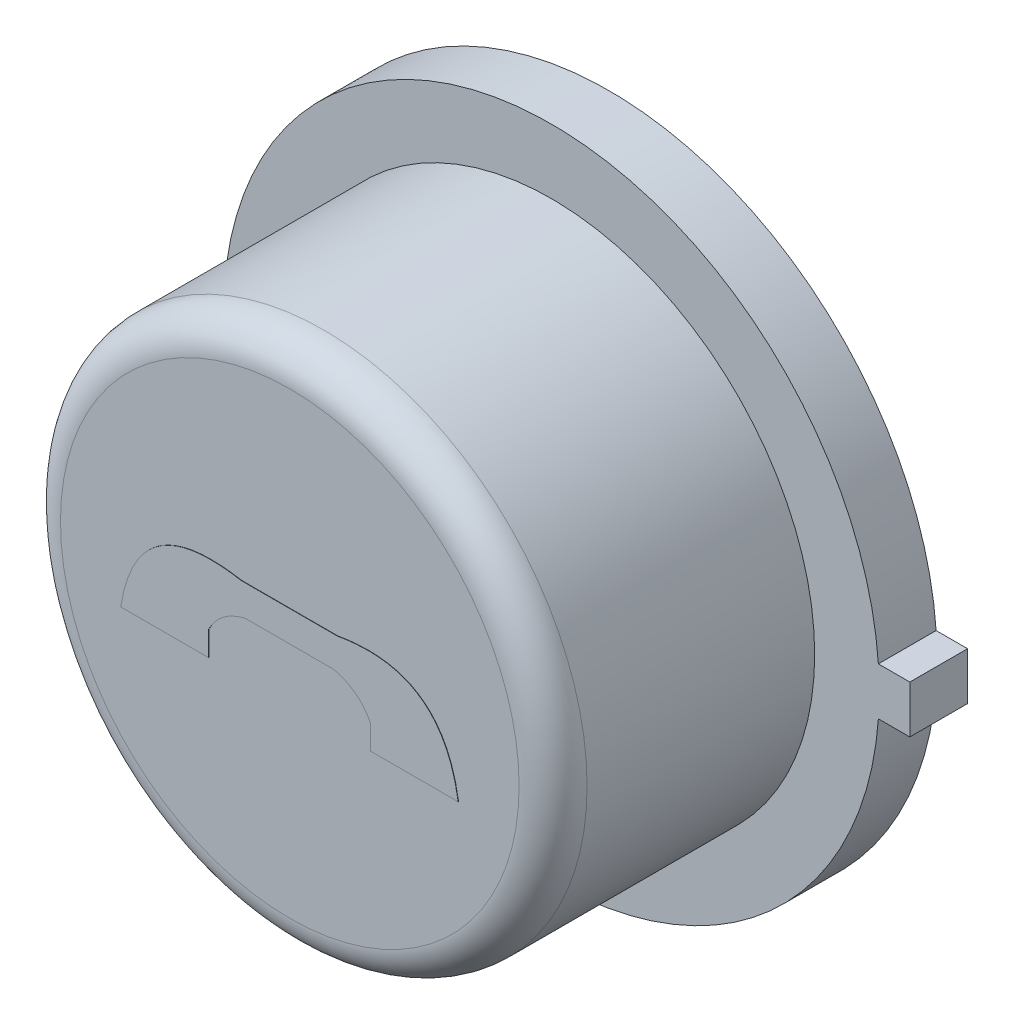
ISO-10303-21;
HEADER;
FILE_DESCRIPTION(('STEP AP214'),'2;1');
FILE_NAME('part.step','',(''),(''),'','','');
FILE_SCHEMA(('AUTOMOTIVE_DESIGN { 1 0 10303 214 1 1 1 1 }'));
ENDSEC;
DATA;
#1=APPLICATION_CONTEXT('core data for automotive mechanical design processes');
#2=APPLICATION_PROTOCOL_DEFINITION('international standard','automotive_design',2000,#1);
#3=PRODUCT_CONTEXT('',#1,'mechanical');
#4=PRODUCT('Part','Part','',(#3));
#5=PRODUCT_RELATED_PRODUCT_CATEGORY('part','',(#4));
#6=PRODUCT_DEFINITION_FORMATION('','',#4);
#7=PRODUCT_DEFINITION_CONTEXT('part definition',#1,'design');
#8=PRODUCT_DEFINITION('design','',#6,#7);
#9=PRODUCT_DEFINITION_SHAPE('','',#8);
#10=(LENGTH_UNIT() NAMED_UNIT(*) SI_UNIT(.MILLI.,.METRE.));
#11=(NAMED_UNIT(*) PLANE_ANGLE_UNIT() SI_UNIT($,.RADIAN.));
#12=(NAMED_UNIT(*) SI_UNIT($,.STERADIAN.) SOLID_ANGLE_UNIT());
#13=UNCERTAINTY_MEASURE_WITH_UNIT(LENGTH_MEASURE(1.E-05),#10,'distance_accuracy_value','');
#14=(GEOMETRIC_REPRESENTATION_CONTEXT(3) GLOBAL_UNCERTAINTY_ASSIGNED_CONTEXT((#13)) GLOBAL_UNIT_ASSIGNED_CONTEXT((#10,
#11,#12)) REPRESENTATION_CONTEXT('',''));
#15=CARTESIAN_POINT('',(0.,0.,0.));
#16=DIRECTION('',(0.,0.,1.));
#17=DIRECTION('',(1.,0.,0.));
#18=AXIS2_PLACEMENT_3D('',#15,#16,#17);
#19=CARTESIAN_POINT('',(0.,0.,2.3876));
#20=DIRECTION('',(0.,0.,1.));
#21=DIRECTION('',(1.,0.,0.));
#22=AXIS2_PLACEMENT_3D('',#19,#20,#21);
#23=PLANE('',#22);
#24=CARTESIAN_POINT('',(0.,0.,2.3876));
#25=DIRECTION('',(0.,0.,1.));
#26=DIRECTION('',(1.,0.,0.));
#27=AXIS2_PLACEMENT_3D('',#24,#25,#26);
#28=CIRCLE('',#27,1.7145);
#29=CARTESIAN_POINT('',(1.7145,0.,2.3876));
#30=VERTEX_POINT('',#29);
#31=EDGE_CURVE('E43',#30,#30,#28,.T.);
#32=ORIENTED_EDGE('',*,*,#31,.T.);
#33=EDGE_LOOP('',(#32));
#34=FACE_BOUND('',#33,.T.);
#35=CARTESIAN_POINT('',(0.605919476379509,-0.145694878798674,2.3876));
#36=CARTESIAN_POINT('',(0.520411043392596,0.0208845483871325,2.3876));
#37=CARTESIAN_POINT('',(0.328774142567382,0.0645533054725954,2.3876));
#38=B_SPLINE_CURVE_WITH_KNOTS('',2,(#35,#36,#37),.UNSPECIFIED.,.F.,.F.,(3,3),(0.,1.),.UNSPECIFIED.);
#39=CARTESIAN_POINT('',(0.605919476379509,-0.145694878798674,2.3876));
#40=VERTEX_POINT('',#39);
#41=CARTESIAN_POINT('',(0.328774142567381,0.0645533054725953,2.3876));
#42=VERTEX_POINT('',#41);
#43=EDGE_CURVE('E447',#40,#42,#38,.T.);
#44=ORIENTED_EDGE('',*,*,#43,.T.);
#45=DIRECTION('',(1.,0.,0.));
#46=VECTOR('',#45,1.);
#47=CARTESIAN_POINT('',(0.,0.0645533054725953,2.3876));
#48=LINE('',#47,#46);
#49=CARTESIAN_POINT('',(-0.328774142567381,0.0645533054725953,2.3876));
#50=VERTEX_POINT('',#49);
#51=EDGE_CURVE('E160',#50,#42,#48,.T.);
#52=ORIENTED_EDGE('',*,*,#51,.F.);
#53=CARTESIAN_POINT('',(-0.605919476379509,-0.145694878798674,2.3876));
#54=CARTESIAN_POINT('',(-0.520411043392595,0.0208845483871324,2.3876));
#55=CARTESIAN_POINT('',(-0.328774142567381,0.0645533054725953,2.3876));
#56=B_SPLINE_CURVE_WITH_KNOTS('',2,(#53,#54,#55),.UNSPECIFIED.,.F.,.F.,(3,3),(0.,1.),.UNSPECIFIED.);
#57=CARTESIAN_POINT('',(-0.605919476379509,-0.145694878798674,2.3876));
#58=VERTEX_POINT('',#57);
#59=EDGE_CURVE('E154',#58,#50,#56,.T.);
#60=ORIENTED_EDGE('',*,*,#59,.F.);
#61=DIRECTION('',(0.,1.,0.));
#62=VECTOR('',#61,1.);
#63=CARTESIAN_POINT('',(-0.605919476379509,-3.91332135623731,2.3876));
#64=LINE('',#63,#62);
#65=CARTESIAN_POINT('',(-0.605919476379509,-0.327272856123861,2.3876));
#66=VERTEX_POINT('',#65);
#67=EDGE_CURVE('E481',#66,#58,#64,.T.);
#68=ORIENTED_EDGE('',*,*,#67,.F.);
#69=DIRECTION('',(1.,0.,0.));
#70=VECTOR('',#69,1.);
#71=CARTESIAN_POINT('',(0.,-0.327272856123861,2.3876));
#72=LINE('',#71,#70);
#73=CARTESIAN_POINT('',(-1.26168609818704,-0.327272856123861,2.3876));
#74=VERTEX_POINT('',#73);
#75=EDGE_CURVE('E476',#74,#66,#72,.T.);
#76=ORIENTED_EDGE('',*,*,#75,.F.);
#77=CARTESIAN_POINT('',(-1.26168609818704,-0.327272856123861,2.3876));
#78=CARTESIAN_POINT('',(-1.14250792995546,0.434027967655186,2.3876));
#79=CARTESIAN_POINT('',(-0.35985696491855,0.293914961041253,2.3876));
#80=B_SPLINE_CURVE_WITH_KNOTS('',2,(#77,#78,#79),.UNSPECIFIED.,.F.,.F.,(3,3),(0.,1.),.UNSPECIFIED.);
#81=CARTESIAN_POINT('',(-0.35985696491855,0.293914961041253,2.3876));
#82=VERTEX_POINT('',#81);
#83=EDGE_CURVE('E471',#74,#82,#80,.T.);
#84=ORIENTED_EDGE('',*,*,#83,.T.);
#85=DIRECTION('',(1.,0.,0.));
#86=VECTOR('',#85,1.);
#87=CARTESIAN_POINT('',(0.,0.293914961041253,2.3876));
#88=LINE('',#87,#86);
#89=CARTESIAN_POINT('',(0.35985696491855,0.293914961041253,2.3876));
#90=VERTEX_POINT('',#89);
#91=EDGE_CURVE('E465',#82,#90,#88,.T.);
#92=ORIENTED_EDGE('',*,*,#91,.T.);
#93=CARTESIAN_POINT('',(1.26168609818704,-0.327272856123861,2.3876));
#94=CARTESIAN_POINT('',(1.14250792995546,0.434027967655186,2.3876));
#95=CARTESIAN_POINT('',(0.35985696491855,0.293914961041253,2.3876));
#96=B_SPLINE_CURVE_WITH_KNOTS('',2,(#93,#94,#95),.UNSPECIFIED.,.F.,.F.,(3,3),(0.,1.),.UNSPECIFIED.);
#97=CARTESIAN_POINT('',(1.26168609818704,-0.327272856123861,2.3876));
#98=VERTEX_POINT('',#97);
#99=EDGE_CURVE('E460',#98,#90,#96,.T.);
#100=ORIENTED_EDGE('',*,*,#99,.F.);
#101=DIRECTION('',(-1.,0.,0.));
#102=VECTOR('',#101,1.);
#103=CARTESIAN_POINT('',(0.,-0.327272856123861,2.3876));
#104=LINE('',#103,#102);
#105=CARTESIAN_POINT('',(0.605919476379509,-0.327272856123861,2.3876));
#106=VERTEX_POINT('',#105);
#107=EDGE_CURVE('E457',#98,#106,#104,.T.);
#108=ORIENTED_EDGE('',*,*,#107,.T.);
#109=DIRECTION('',(0.,1.,0.));
#110=VECTOR('',#109,1.);
#111=CARTESIAN_POINT('',(0.605919476379509,-3.91332135623731,2.3876));
#112=LINE('',#111,#110);
#113=EDGE_CURVE('E451',#106,#40,#112,.T.);
#114=ORIENTED_EDGE('',*,*,#113,.T.);
#115=EDGE_LOOP('',(#44,#52,#60,#68,#76,#84,#92,#100,#108,#114));
#116=FACE_BOUND('',#115,.T.);
#117=ADVANCED_FACE('F35',(#34,#116),#23,.T.);
#118=CARTESIAN_POINT('',(-0.00322860507148085,-5.53029106093277,0.));
#119=DIRECTION('',(0.,0.,1.));
#120=DIRECTION('',(1.,0.,0.));
#121=AXIS2_PLACEMENT_3D('',#118,#119,#120);
#122=PLANE('',#121);
#123=DIRECTION('',(1.,0.,0.));
#124=VECTOR('',#123,1.);
#125=CARTESIAN_POINT('',(-0.0032286050714822,0.177799999999999,0.));
#126=LINE('',#125,#124);
#127=CARTESIAN_POINT('',(2.44464278985704,0.177799999999999,0.));
#128=VERTEX_POINT('',#127);
#129=CARTESIAN_POINT('',(2.6797,0.177799999999999,0.));
#130=VERTEX_POINT('',#129);
#131=EDGE_CURVE('E224',#128,#130,#126,.T.);
#132=ORIENTED_EDGE('',*,*,#131,.T.);
#133=DIRECTION('',(0.,-1.,0.));
#134=VECTOR('',#133,1.);
#135=CARTESIAN_POINT('',(2.6797,-5.53029106093277,0.));
#136=LINE('',#135,#134);
#137=CARTESIAN_POINT('',(2.6797,-0.1778,0.));
#138=VERTEX_POINT('',#137);
#139=EDGE_CURVE('E241',#130,#138,#136,.T.);
#140=ORIENTED_EDGE('',*,*,#139,.T.);
#141=DIRECTION('',(-1.,0.,0.));
#142=VECTOR('',#141,1.);
#143=CARTESIAN_POINT('',(-0.00322860507148085,-0.1778,0.));
#144=LINE('',#143,#142);
#145=CARTESIAN_POINT('',(2.44464278985704,-0.1778,0.));
#146=VERTEX_POINT('',#145);
#147=EDGE_CURVE('E231',#138,#146,#144,.T.);
#148=ORIENTED_EDGE('',*,*,#147,.T.);
#149=CARTESIAN_POINT('',(0.,0.,0.));
#150=DIRECTION('',(0.,0.,1.));
#151=DIRECTION('',(1.,0.,0.));
#152=AXIS2_PLACEMENT_3D('',#149,#150,#151);
#153=CIRCLE('',#152,2.4511);
#154=EDGE_CURVE('E227',#128,#146,#153,.T.);
#155=ORIENTED_EDGE('',*,*,#154,.F.);
#156=EDGE_LOOP('',(#132,#140,#148,#155));
#157=FACE_BOUND('',#156,.T.);
#158=CARTESIAN_POINT('',(0.,0.,0.));
#159=DIRECTION('',(0.,0.,1.));
#160=DIRECTION('',(1.,0.,0.));
#161=AXIS2_PLACEMENT_3D('',#158,#159,#160);
#162=CIRCLE('',#161,1.75756648099992);
#163=CARTESIAN_POINT('',(1.75756648099992,0.,0.));
#164=VERTEX_POINT('',#163);
#165=EDGE_CURVE('E250',#164,#164,#162,.F.);
#166=ORIENTED_EDGE('',*,*,#165,.F.);
#167=EDGE_LOOP('',(#166));
#168=FACE_BOUND('',#167,.T.);
#169=ADVANCED_FACE('F198',(#157,#168),#122,.F.);
#170=CARTESIAN_POINT('',(-0.00322860507148085,-5.53029106093277,0.4318));
#171=DIRECTION('',(0.,0.,1.));
#172=DIRECTION('',(1.,0.,0.));
#173=AXIS2_PLACEMENT_3D('',#170,#171,#172);
#174=PLANE('',#173);
#175=DIRECTION('',(1.,0.,0.));
#176=VECTOR('',#175,1.);
#177=CARTESIAN_POINT('',(-0.0032286050714822,0.177799999999999,0.4318));
#178=LINE('',#177,#176);
#179=CARTESIAN_POINT('',(2.44464278985704,0.177799999999999,0.4318));
#180=VERTEX_POINT('',#179);
#181=CARTESIAN_POINT('',(2.6797,0.177799999999999,0.4318));
#182=VERTEX_POINT('',#181);
#183=EDGE_CURVE('E243',#180,#182,#178,.T.);
#184=ORIENTED_EDGE('',*,*,#183,.F.);
#185=CARTESIAN_POINT('',(0.,0.,0.4318));
#186=DIRECTION('',(0.,0.,1.));
#187=DIRECTION('',(1.,0.,0.));
#188=AXIS2_PLACEMENT_3D('',#185,#186,#187);
#189=CIRCLE('',#188,2.4511);
#190=CARTESIAN_POINT('',(2.44464278985704,-0.1778,0.4318));
#191=VERTEX_POINT('',#190);
#192=EDGE_CURVE('E508',#180,#191,#189,.T.);
#193=ORIENTED_EDGE('',*,*,#192,.T.);
#194=DIRECTION('',(-1.,0.,0.));
#195=VECTOR('',#194,1.);
#196=CARTESIAN_POINT('',(-0.00322860507148085,-0.1778,0.4318));
#197=LINE('',#196,#195);
#198=CARTESIAN_POINT('',(2.6797,-0.1778,0.4318));
#199=VERTEX_POINT('',#198);
#200=EDGE_CURVE('E509',#199,#191,#197,.T.);
#201=ORIENTED_EDGE('',*,*,#200,.F.);
#202=DIRECTION('',(0.,-1.,0.));
#203=VECTOR('',#202,1.);
#204=CARTESIAN_POINT('',(2.6797,-5.53029106093277,0.4318));
#205=LINE('',#204,#203);
#206=EDGE_CURVE('E236',#182,#199,#205,.T.);
#207=ORIENTED_EDGE('',*,*,#206,.F.);
#208=EDGE_LOOP('',(#184,#193,#201,#207));
#209=FACE_BOUND('',#208,.T.);
#210=CARTESIAN_POINT('',(0.,0.,0.4318));
#211=DIRECTION('',(0.,0.,1.));
#212=DIRECTION('',(1.,0.,0.));
#213=AXIS2_PLACEMENT_3D('',#210,#211,#212);
#214=CIRCLE('',#213,1.9685);
#215=CARTESIAN_POINT('',(1.9685,0.,0.4318));
#216=VERTEX_POINT('',#215);
#217=EDGE_CURVE('E228',#216,#216,#214,.T.);
#218=ORIENTED_EDGE('',*,*,#217,.F.);
#219=EDGE_LOOP('',(#218));
#220=FACE_BOUND('',#219,.T.);
#221=ADVANCED_FACE('F204',(#209,#220),#174,.T.);
#222=CARTESIAN_POINT('',(-0.0032286050714822,0.177799999999999,0.4318));
#223=DIRECTION('',(0.,1.,0.));
#224=DIRECTION('',(-1.,0.,0.));
#225=AXIS2_PLACEMENT_3D('',#222,#223,#224);
#226=PLANE('',#225);
#227=ORIENTED_EDGE('',*,*,#131,.F.);
#228=DIRECTION('',(0.,0.,-1.));
#229=VECTOR('',#228,1.);
#230=CARTESIAN_POINT('',(2.44464278985704,0.177799999999999,0.4318));
#231=LINE('',#230,#229);
#232=EDGE_CURVE('E82',#180,#128,#231,.T.);
#233=ORIENTED_EDGE('',*,*,#232,.F.);
#234=ORIENTED_EDGE('',*,*,#183,.T.);
#235=DIRECTION('',(0.,0.,-1.));
#236=VECTOR('',#235,1.);
#237=CARTESIAN_POINT('',(2.6797,0.177799999999999,0.4318));
#238=LINE('',#237,#236);
#239=EDGE_CURVE('E59',#182,#130,#238,.T.);
#240=ORIENTED_EDGE('',*,*,#239,.T.);
#241=EDGE_LOOP('',(#227,#233,#234,#240));
#242=FACE_BOUND('',#241,.T.);
#243=ADVANCED_FACE('F207',(#242),#226,.T.);
#244=CARTESIAN_POINT('',(0.,0.,0.4318));
#245=DIRECTION('',(0.,0.,-1.));
#246=DIRECTION('',(-1.,0.,0.));
#247=AXIS2_PLACEMENT_3D('',#244,#245,#246);
#248=CYLINDRICAL_SURFACE('',#247,2.4511);
#249=ORIENTED_EDGE('',*,*,#154,.T.);
#250=DIRECTION('',(0.,0.,-1.));
#251=VECTOR('',#250,1.);
#252=CARTESIAN_POINT('',(2.44464278985704,-0.1778,0.4318));
#253=LINE('',#252,#251);
#254=EDGE_CURVE('E247',#191,#146,#253,.T.);
#255=ORIENTED_EDGE('',*,*,#254,.F.);
#256=ORIENTED_EDGE('',*,*,#192,.F.);
#257=ORIENTED_EDGE('',*,*,#232,.T.);
#258=EDGE_LOOP('',(#249,#255,#256,#257));
#259=FACE_BOUND('',#258,.T.);
#260=ADVANCED_FACE('F217',(#259),#248,.T.);
#261=CARTESIAN_POINT('',(-0.00322860507148085,-0.1778,0.4318));
#262=DIRECTION('',(0.,-1.,0.));
#263=DIRECTION('',(0.,0.,-1.));
#264=AXIS2_PLACEMENT_3D('',#261,#262,#263);
#265=PLANE('',#264);
#266=ORIENTED_EDGE('',*,*,#147,.F.);
#267=DIRECTION('',(0.,0.,-1.));
#268=VECTOR('',#267,1.);
#269=CARTESIAN_POINT('',(2.6797,-0.1778,0.4318));
#270=LINE('',#269,#268);
#271=EDGE_CURVE('E245',#199,#138,#270,.T.);
#272=ORIENTED_EDGE('',*,*,#271,.F.);
#273=ORIENTED_EDGE('',*,*,#200,.T.);
#274=ORIENTED_EDGE('',*,*,#254,.T.);
#275=EDGE_LOOP('',(#266,#272,#273,#274));
#276=FACE_BOUND('',#275,.T.);
#277=ADVANCED_FACE('F214',(#276),#265,.T.);
#278=CARTESIAN_POINT('',(2.6797,-5.53029106093277,0.4318));
#279=DIRECTION('',(1.,0.,0.));
#280=DIRECTION('',(0.,0.,-1.));
#281=AXIS2_PLACEMENT_3D('',#278,#279,#280);
#282=PLANE('',#281);
#283=ORIENTED_EDGE('',*,*,#139,.F.);
#284=ORIENTED_EDGE('',*,*,#239,.F.);
#285=ORIENTED_EDGE('',*,*,#206,.T.);
#286=ORIENTED_EDGE('',*,*,#271,.T.);
#287=EDGE_LOOP('',(#283,#284,#285,#286));
#288=FACE_BOUND('',#287,.T.);
#289=ADVANCED_FACE('F202',(#288),#282,.T.);
#290=CARTESIAN_POINT('',(0.,0.,2.3876));
#291=DIRECTION('',(0.,0.,-1.));
#292=DIRECTION('',(-1.,0.,0.));
#293=AXIS2_PLACEMENT_3D('',#290,#291,#292);
#294=CYLINDRICAL_SURFACE('',#293,1.9685);
#295=CARTESIAN_POINT('',(0.,0.,2.1336));
#296=DIRECTION('',(0.,0.,1.));
#297=DIRECTION('',(1.,0.,0.));
#298=AXIS2_PLACEMENT_3D('',#295,#296,#297);
#299=CIRCLE('',#298,1.9685);
#300=CARTESIAN_POINT('',(1.9685,0.,2.1336));
#301=VERTEX_POINT('',#300);
#302=EDGE_CURVE('E11',#301,#301,#299,.F.);
#303=ORIENTED_EDGE('',*,*,#302,.T.);
#304=EDGE_LOOP('',(#303));
#305=FACE_BOUND('',#304,.T.);
#306=ORIENTED_EDGE('',*,*,#217,.T.);
#307=EDGE_LOOP('',(#306));
#308=FACE_BOUND('',#307,.T.);
#309=ADVANCED_FACE('F194',(#305,#308),#294,.T.);
#310=CARTESIAN_POINT('',(0.,0.,-0.00254));
#311=DIRECTION('',(0.,0.,1.));
#312=DIRECTION('',(1.,0.,0.));
#313=AXIS2_PLACEMENT_3D('',#310,#311,#312);
#314=CYLINDRICAL_SURFACE('',#313,1.75756648099992);
#315=CARTESIAN_POINT('',(0.,0.,-0.00254));
#316=DIRECTION('',(0.,0.,-1.));
#317=DIRECTION('',(-1.,0.,0.));
#318=AXIS2_PLACEMENT_3D('',#315,#316,#317);
#319=CIRCLE('',#318,1.75756648099992);
#320=CARTESIAN_POINT('',(-1.75756648099992,0.,-0.00254));
#321=VERTEX_POINT('',#320);
#322=EDGE_CURVE('E164',#321,#321,#319,.T.);
#323=ORIENTED_EDGE('',*,*,#322,.F.);
#324=EDGE_LOOP('',(#323));
#325=FACE_BOUND('',#324,.T.);
#326=ORIENTED_EDGE('',*,*,#165,.T.);
#327=EDGE_LOOP('',(#326));
#328=FACE_BOUND('',#327,.T.);
#329=ADVANCED_FACE('F190',(#325,#328),#314,.T.);
#330=CARTESIAN_POINT('',(0.,0.,-0.00254));
#331=DIRECTION('',(0.,0.,-1.));
#332=DIRECTION('',(-1.,0.,0.));
#333=AXIS2_PLACEMENT_3D('',#330,#331,#332);
#334=PLANE('',#333);
#335=ORIENTED_EDGE('',*,*,#322,.T.);
#336=EDGE_LOOP('',(#335));
#337=FACE_BOUND('',#336,.T.);
#338=ADVANCED_FACE('F187',(#337),#334,.T.);
#339=CARTESIAN_POINT('',(0.,0.,2.1336));
#340=DIRECTION('',(0.,0.,1.));
#341=DIRECTION('',(1.,0.,0.));
#342=AXIS2_PLACEMENT_3D('',#339,#340,#341);
#343=TOROIDAL_SURFACE('',#342,1.7145,0.254);
#344=ORIENTED_EDGE('',*,*,#302,.F.);
#345=EDGE_LOOP('',(#344));
#346=FACE_BOUND('',#345,.T.);
#347=ORIENTED_EDGE('',*,*,#31,.F.);
#348=EDGE_LOOP('',(#347));
#349=FACE_BOUND('',#348,.T.);
#350=ADVANCED_FACE('F37',(#346,#349),#343,.T.);
#351=CARTESIAN_POINT('',(0.,0.0645533054725953,2.39014));
#352=DIRECTION('',(0.,1.,0.));
#353=DIRECTION('',(0.,0.,1.));
#354=AXIS2_PLACEMENT_3D('',#351,#352,#353);
#355=PLANE('',#354);
#356=ORIENTED_EDGE('',*,*,#51,.T.);
#357=DIRECTION('',(0.,0.,-1.));
#358=VECTOR('',#357,1.);
#359=CARTESIAN_POINT('',(0.328774142567381,0.0645533054725953,2.39014));
#360=LINE('',#359,#358);
#361=CARTESIAN_POINT('',(0.328774142567381,0.0645533054725953,2.39014));
#362=VERTEX_POINT('',#361);
#363=EDGE_CURVE('E157',#362,#42,#360,.T.);
#364=ORIENTED_EDGE('',*,*,#363,.F.);
#365=DIRECTION('',(1.,0.,0.));
#366=VECTOR('',#365,1.);
#367=CARTESIAN_POINT('',(0.,0.0645533054725953,2.39014));
#368=LINE('',#367,#366);
#369=CARTESIAN_POINT('',(-0.328774142567381,0.0645533054725953,2.39014));
#370=VERTEX_POINT('',#369);
#371=EDGE_CURVE('E143',#370,#362,#368,.T.);
#372=ORIENTED_EDGE('',*,*,#371,.F.);
#373=DIRECTION('',(0.,0.,-1.));
#374=VECTOR('',#373,1.);
#375=CARTESIAN_POINT('',(-0.328774142567381,0.0645533054725953,2.39014));
#376=LINE('',#375,#374);
#377=EDGE_CURVE('E440',#370,#50,#376,.T.);
#378=ORIENTED_EDGE('',*,*,#377,.T.);
#379=EDGE_LOOP('',(#356,#364,#372,#378));
#380=FACE_BOUND('',#379,.T.);
#381=ADVANCED_FACE('F158',(#380),#355,.F.);
#382=CARTESIAN_POINT('',(0.605919476379509,-0.145694878798674,2.39014));
#383=CARTESIAN_POINT('',(0.520411043392596,0.0208845483871325,2.39014));
#384=CARTESIAN_POINT('',(0.328774142567382,0.0645533054725954,2.39014));
#385=B_SPLINE_CURVE_WITH_KNOTS('',2,(#382,#383,#384),.UNSPECIFIED.,.F.,.F.,(3,3),(0.,1.),.UNSPECIFIED.);
#386=DIRECTION('',(0.,0.,-1.));
#387=VECTOR('',#386,1.);
#388=SURFACE_OF_LINEAR_EXTRUSION('',#385,#387);
#389=ORIENTED_EDGE('',*,*,#43,.F.);
#390=DIRECTION('',(0.,0.,-1.));
#391=VECTOR('',#390,1.);
#392=CARTESIAN_POINT('',(0.605919476379509,-0.145694878798674,2.39014));
#393=LINE('',#392,#391);
#394=CARTESIAN_POINT('',(0.605919476379509,-0.145694878798674,2.39014));
#395=VERTEX_POINT('',#394);
#396=EDGE_CURVE('E165',#395,#40,#393,.T.);
#397=ORIENTED_EDGE('',*,*,#396,.F.);
#398=EDGE_CURVE('E148',#395,#362,#385,.T.);
#399=ORIENTED_EDGE('',*,*,#398,.T.);
#400=ORIENTED_EDGE('',*,*,#363,.T.);
#401=EDGE_LOOP('',(#389,#397,#399,#400));
#402=FACE_BOUND('',#401,.T.);
#403=ADVANCED_FACE('F167',(#402),#388,.T.);
#404=CARTESIAN_POINT('',(0.605919476379509,-3.91332135623731,2.39014));
#405=DIRECTION('',(-1.,0.,0.));
#406=DIRECTION('',(0.,0.,1.));
#407=AXIS2_PLACEMENT_3D('',#404,#405,#406);
#408=PLANE('',#407);
#409=ORIENTED_EDGE('',*,*,#113,.F.);
#410=DIRECTION('',(0.,0.,-1.));
#411=VECTOR('',#410,1.);
#412=CARTESIAN_POINT('',(0.605919476379509,-0.327272856123861,2.39014));
#413=LINE('',#412,#411);
#414=CARTESIAN_POINT('',(0.605919476379509,-0.327272856123861,2.39014));
#415=VERTEX_POINT('',#414);
#416=EDGE_CURVE('E502',#415,#106,#413,.T.);
#417=ORIENTED_EDGE('',*,*,#416,.F.);
#418=DIRECTION('',(0.,1.,0.));
#419=VECTOR('',#418,1.);
#420=CARTESIAN_POINT('',(0.605919476379509,-3.91332135623731,2.39014));
#421=LINE('',#420,#419);
#422=EDGE_CURVE('E168',#415,#395,#421,.T.);
#423=ORIENTED_EDGE('',*,*,#422,.T.);
#424=ORIENTED_EDGE('',*,*,#396,.T.);
#425=EDGE_LOOP('',(#409,#417,#423,#424));
#426=FACE_BOUND('',#425,.T.);
#427=ADVANCED_FACE('F183',(#426),#408,.T.);
#428=CARTESIAN_POINT('',(0.,-0.327272856123861,2.39014));
#429=DIRECTION('',(0.,-1.,0.));
#430=DIRECTION('',(0.,0.,-1.));
#431=AXIS2_PLACEMENT_3D('',#428,#429,#430);
#432=PLANE('',#431);
#433=ORIENTED_EDGE('',*,*,#107,.F.);
#434=DIRECTION('',(0.,0.,-1.));
#435=VECTOR('',#434,1.);
#436=CARTESIAN_POINT('',(1.26168609818704,-0.327272856123861,2.39014));
#437=LINE('',#436,#435);
#438=CARTESIAN_POINT('',(1.26168609818704,-0.327272856123861,2.39014));
#439=VERTEX_POINT('',#438);
#440=EDGE_CURVE('E500',#439,#98,#437,.T.);
#441=ORIENTED_EDGE('',*,*,#440,.F.);
#442=DIRECTION('',(-1.,0.,0.));
#443=VECTOR('',#442,1.);
#444=CARTESIAN_POINT('',(0.,-0.327272856123861,2.39014));
#445=LINE('',#444,#443);
#446=EDGE_CURVE('E170',#439,#415,#445,.T.);
#447=ORIENTED_EDGE('',*,*,#446,.T.);
#448=ORIENTED_EDGE('',*,*,#416,.T.);
#449=EDGE_LOOP('',(#433,#441,#447,#448));
#450=FACE_BOUND('',#449,.T.);
#451=ADVANCED_FACE('F282',(#450),#432,.T.);
#452=CARTESIAN_POINT('',(1.26168609818704,-0.327272856123861,2.39014));
#453=CARTESIAN_POINT('',(1.14250792995546,0.434027967655186,2.39014));
#454=CARTESIAN_POINT('',(0.35985696491855,0.293914961041253,2.39014));
#455=B_SPLINE_CURVE_WITH_KNOTS('',2,(#452,#453,#454),.UNSPECIFIED.,.F.,.F.,(3,3),(0.,1.),.UNSPECIFIED.);
#456=DIRECTION('',(0.,0.,-1.));
#457=VECTOR('',#456,1.);
#458=SURFACE_OF_LINEAR_EXTRUSION('',#455,#457);
#459=ORIENTED_EDGE('',*,*,#99,.T.);
#460=DIRECTION('',(0.,0.,-1.));
#461=VECTOR('',#460,1.);
#462=CARTESIAN_POINT('',(0.35985696491855,0.293914961041253,2.39014));
#463=LINE('',#462,#461);
#464=CARTESIAN_POINT('',(0.35985696491855,0.293914961041253,2.39014));
#465=VERTEX_POINT('',#464);
#466=EDGE_CURVE('E498',#465,#90,#463,.T.);
#467=ORIENTED_EDGE('',*,*,#466,.F.);
#468=EDGE_CURVE('E527',#439,#465,#455,.T.);
#469=ORIENTED_EDGE('',*,*,#468,.F.);
#470=ORIENTED_EDGE('',*,*,#440,.T.);
#471=EDGE_LOOP('',(#459,#467,#469,#470));
#472=FACE_BOUND('',#471,.T.);
#473=ADVANCED_FACE('F289',(#472),#458,.F.);
#474=CARTESIAN_POINT('',(0.,0.293914961041253,2.39014));
#475=DIRECTION('',(0.,1.,0.));
#476=DIRECTION('',(0.,0.,1.));
#477=AXIS2_PLACEMENT_3D('',#474,#475,#476);
#478=PLANE('',#477);
#479=ORIENTED_EDGE('',*,*,#91,.F.);
#480=DIRECTION('',(0.,0.,-1.));
#481=VECTOR('',#480,1.);
#482=CARTESIAN_POINT('',(-0.35985696491855,0.293914961041253,2.39014));
#483=LINE('',#482,#481);
#484=CARTESIAN_POINT('',(-0.35985696491855,0.293914961041253,2.39014));
#485=VERTEX_POINT('',#484);
#486=EDGE_CURVE('E496',#485,#82,#483,.T.);
#487=ORIENTED_EDGE('',*,*,#486,.F.);
#488=DIRECTION('',(1.,0.,0.));
#489=VECTOR('',#488,1.);
#490=CARTESIAN_POINT('',(0.,0.293914961041253,2.39014));
#491=LINE('',#490,#489);
#492=EDGE_CURVE('E529',#485,#465,#491,.T.);
#493=ORIENTED_EDGE('',*,*,#492,.T.);
#494=ORIENTED_EDGE('',*,*,#466,.T.);
#495=EDGE_LOOP('',(#479,#487,#493,#494));
#496=FACE_BOUND('',#495,.T.);
#497=ADVANCED_FACE('F296',(#496),#478,.T.);
#498=CARTESIAN_POINT('',(-1.26168609818704,-0.327272856123861,2.39014));
#499=CARTESIAN_POINT('',(-1.14250792995546,0.434027967655186,2.39014));
#500=CARTESIAN_POINT('',(-0.35985696491855,0.293914961041253,2.39014));
#501=B_SPLINE_CURVE_WITH_KNOTS('',2,(#498,#499,#500),.UNSPECIFIED.,.F.,.F.,(3,3),(0.,1.),.UNSPECIFIED.);
#502=DIRECTION('',(0.,0.,-1.));
#503=VECTOR('',#502,1.);
#504=SURFACE_OF_LINEAR_EXTRUSION('',#501,#503);
#505=ORIENTED_EDGE('',*,*,#83,.F.);
#506=DIRECTION('',(0.,0.,-1.));
#507=VECTOR('',#506,1.);
#508=CARTESIAN_POINT('',(-1.26168609818704,-0.327272856123861,2.39014));
#509=LINE('',#508,#507);
#510=CARTESIAN_POINT('',(-1.26168609818704,-0.327272856123861,2.39014));
#511=VERTEX_POINT('',#510);
#512=EDGE_CURVE('E494',#511,#74,#509,.T.);
#513=ORIENTED_EDGE('',*,*,#512,.F.);
#514=EDGE_CURVE('E539',#511,#485,#501,.T.);
#515=ORIENTED_EDGE('',*,*,#514,.T.);
#516=ORIENTED_EDGE('',*,*,#486,.T.);
#517=EDGE_LOOP('',(#505,#513,#515,#516));
#518=FACE_BOUND('',#517,.T.);
#519=ADVANCED_FACE('F304',(#518),#504,.T.);
#520=CARTESIAN_POINT('',(0.,-0.327272856123861,2.39014));
#521=DIRECTION('',(0.,1.,0.));
#522=DIRECTION('',(0.,0.,1.));
#523=AXIS2_PLACEMENT_3D('',#520,#521,#522);
#524=PLANE('',#523);
#525=ORIENTED_EDGE('',*,*,#75,.T.);
#526=DIRECTION('',(0.,0.,-1.));
#527=VECTOR('',#526,1.);
#528=CARTESIAN_POINT('',(-0.605919476379509,-0.327272856123861,2.39014));
#529=LINE('',#528,#527);
#530=CARTESIAN_POINT('',(-0.605919476379509,-0.327272856123861,2.39014));
#531=VERTEX_POINT('',#530);
#532=EDGE_CURVE('E491',#531,#66,#529,.T.);
#533=ORIENTED_EDGE('',*,*,#532,.F.);
#534=DIRECTION('',(1.,0.,0.));
#535=VECTOR('',#534,1.);
#536=CARTESIAN_POINT('',(0.,-0.327272856123861,2.39014));
#537=LINE('',#536,#535);
#538=EDGE_CURVE('E544',#511,#531,#537,.T.);
#539=ORIENTED_EDGE('',*,*,#538,.F.);
#540=ORIENTED_EDGE('',*,*,#512,.T.);
#541=EDGE_LOOP('',(#525,#533,#539,#540));
#542=FACE_BOUND('',#541,.T.);
#543=ADVANCED_FACE('F312',(#542),#524,.F.);
#544=CARTESIAN_POINT('',(-0.605919476379509,-3.91332135623731,2.39014));
#545=DIRECTION('',(-1.,0.,0.));
#546=DIRECTION('',(0.,0.,1.));
#547=AXIS2_PLACEMENT_3D('',#544,#545,#546);
#548=PLANE('',#547);
#549=ORIENTED_EDGE('',*,*,#67,.T.);
#550=DIRECTION('',(0.,0.,-1.));
#551=VECTOR('',#550,1.);
#552=CARTESIAN_POINT('',(-0.605919476379509,-0.145694878798674,2.39014));
#553=LINE('',#552,#551);
#554=CARTESIAN_POINT('',(-0.605919476379509,-0.145694878798674,2.39014));
#555=VERTEX_POINT('',#554);
#556=EDGE_CURVE('E50',#555,#58,#553,.T.);
#557=ORIENTED_EDGE('',*,*,#556,.F.);
#558=DIRECTION('',(0.,1.,0.));
#559=VECTOR('',#558,1.);
#560=CARTESIAN_POINT('',(-0.605919476379509,-3.91332135623731,2.39014));
#561=LINE('',#560,#559);
#562=EDGE_CURVE('E441',#531,#555,#561,.T.);
#563=ORIENTED_EDGE('',*,*,#562,.F.);
#564=ORIENTED_EDGE('',*,*,#532,.T.);
#565=EDGE_LOOP('',(#549,#557,#563,#564));
#566=FACE_BOUND('',#565,.T.);
#567=ADVANCED_FACE('F320',(#566),#548,.F.);
#568=CARTESIAN_POINT('',(-0.605919476379509,-0.145694878798674,2.39014));
#569=CARTESIAN_POINT('',(-0.520411043392595,0.0208845483871324,2.39014));
#570=CARTESIAN_POINT('',(-0.328774142567381,0.0645533054725953,2.39014));
#571=B_SPLINE_CURVE_WITH_KNOTS('',2,(#568,#569,#570),.UNSPECIFIED.,.F.,.F.,(3,3),(0.,1.),.UNSPECIFIED.);
#572=DIRECTION('',(0.,0.,-1.));
#573=VECTOR('',#572,1.);
#574=SURFACE_OF_LINEAR_EXTRUSION('',#571,#573);
#575=ORIENTED_EDGE('',*,*,#59,.T.);
#576=ORIENTED_EDGE('',*,*,#377,.F.);
#577=EDGE_CURVE('E150',#555,#370,#571,.T.);
#578=ORIENTED_EDGE('',*,*,#577,.F.);
#579=ORIENTED_EDGE('',*,*,#556,.T.);
#580=EDGE_LOOP('',(#575,#576,#578,#579));
#581=FACE_BOUND('',#580,.T.);
#582=ADVANCED_FACE('F328',(#581),#574,.F.);
#583=CARTESIAN_POINT('',(0.,-3.91332135623731,2.39014));
#584=DIRECTION('',(0.,0.,1.));
#585=DIRECTION('',(1.,0.,0.));
#586=AXIS2_PLACEMENT_3D('',#583,#584,#585);
#587=PLANE('',#586);
#588=ORIENTED_EDGE('',*,*,#371,.T.);
#589=ORIENTED_EDGE('',*,*,#398,.F.);
#590=ORIENTED_EDGE('',*,*,#422,.F.);
#591=ORIENTED_EDGE('',*,*,#446,.F.);
#592=ORIENTED_EDGE('',*,*,#468,.T.);
#593=ORIENTED_EDGE('',*,*,#492,.F.);
#594=ORIENTED_EDGE('',*,*,#514,.F.);
#595=ORIENTED_EDGE('',*,*,#538,.T.);
#596=ORIENTED_EDGE('',*,*,#562,.T.);
#597=ORIENTED_EDGE('',*,*,#577,.T.);
#598=EDGE_LOOP('',(#588,#589,#590,#591,#592,#593,#594,#595,#596,#597));
#599=FACE_BOUND('',#598,.T.);
#600=ADVANCED_FACE('F145',(#599),#587,.T.);
#601=CLOSED_SHELL('',(#117,#169,#221,#243,#260,#277,#289,#309,#329,#338,#350,#381,#403,#427,
#451,#473,#497,#519,#543,#567,#582,#600));
#602=MANIFOLD_SOLID_BREP('B2',#601);
#603=ADVANCED_BREP_SHAPE_REPRESENTATION('',(#18,#602),#14);
#604=SHAPE_DEFINITION_REPRESENTATION(#9,#603);
ENDSEC;
END-ISO-10303-21;
